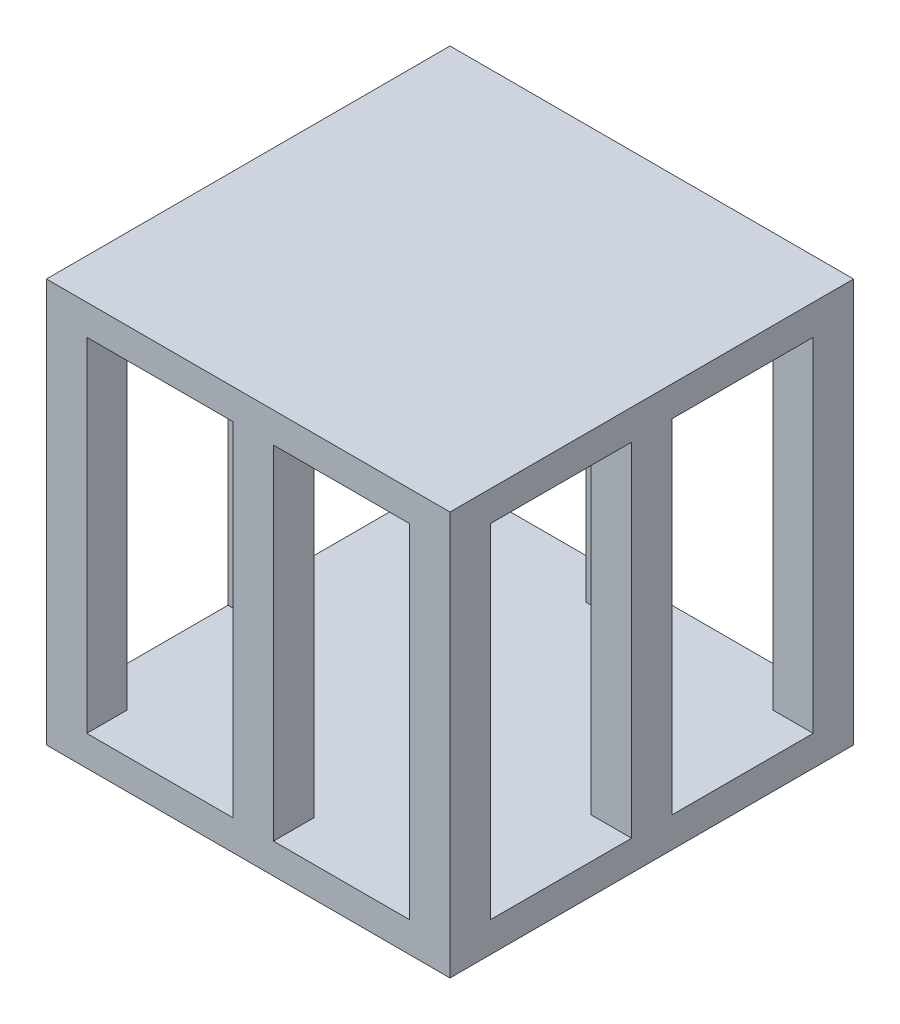
ISO-10303-21;
HEADER;
FILE_DESCRIPTION(('STEP AP214'),'2;1');
FILE_NAME('part.step','',(''),(''),'','','');
FILE_SCHEMA(('AUTOMOTIVE_DESIGN { 1 0 10303 214 1 1 1 1 }'));
ENDSEC;
DATA;
#1=APPLICATION_CONTEXT('core data for automotive mechanical design processes');
#2=APPLICATION_PROTOCOL_DEFINITION('international standard','automotive_design',2000,#1);
#3=PRODUCT_CONTEXT('',#1,'mechanical');
#4=PRODUCT('Part','Part','',(#3));
#5=PRODUCT_RELATED_PRODUCT_CATEGORY('part','',(#4));
#6=PRODUCT_DEFINITION_FORMATION('','',#4);
#7=PRODUCT_DEFINITION_CONTEXT('part definition',#1,'design');
#8=PRODUCT_DEFINITION('design','',#6,#7);
#9=PRODUCT_DEFINITION_SHAPE('','',#8);
#10=(LENGTH_UNIT() NAMED_UNIT(*) SI_UNIT(.MILLI.,.METRE.));
#11=(NAMED_UNIT(*) PLANE_ANGLE_UNIT() SI_UNIT($,.RADIAN.));
#12=(NAMED_UNIT(*) SI_UNIT($,.STERADIAN.) SOLID_ANGLE_UNIT());
#13=UNCERTAINTY_MEASURE_WITH_UNIT(LENGTH_MEASURE(1.E-05),#10,'distance_accuracy_value','');
#14=(GEOMETRIC_REPRESENTATION_CONTEXT(3) GLOBAL_UNCERTAINTY_ASSIGNED_CONTEXT((#13)) GLOBAL_UNIT_ASSIGNED_CONTEXT((#10,
#11,#12)) REPRESENTATION_CONTEXT('',''));
#15=CARTESIAN_POINT('',(0.,0.,0.));
#16=DIRECTION('',(0.,0.,1.));
#17=DIRECTION('',(1.,0.,0.));
#18=AXIS2_PLACEMENT_3D('',#15,#16,#17);
#19=CARTESIAN_POINT('',(25.4,21.59,-25.4));
#20=DIRECTION('',(0.,1.,0.));
#21=DIRECTION('',(0.,0.,1.));
#22=AXIS2_PLACEMENT_3D('',#19,#20,#21);
#23=PLANE('',#22);
#24=DIRECTION('',(0.,0.,-1.));
#25=VECTOR('',#24,1.);
#26=CARTESIAN_POINT('',(-3.17500000000003,21.59,-45.72));
#27=LINE('',#26,#25);
#28=CARTESIAN_POINT('',(-3.17500000000003,21.59,-20.32));
#29=VERTEX_POINT('',#28);
#30=CARTESIAN_POINT('',(-3.17500000000003,21.59,-25.4));
#31=VERTEX_POINT('',#30);
#32=EDGE_CURVE('E53',#29,#31,#27,.T.);
#33=ORIENTED_EDGE('',*,*,#32,.F.);
#34=DIRECTION('',(-1.,0.,0.));
#35=VECTOR('',#34,1.);
#36=CARTESIAN_POINT('',(32.5264213562373,21.59,-20.32));
#37=LINE('',#36,#35);
#38=CARTESIAN_POINT('',(1.90499999999998,21.59,-20.32));
#39=VERTEX_POINT('',#38);
#40=EDGE_CURVE('E294',#39,#29,#37,.T.);
#41=ORIENTED_EDGE('',*,*,#40,.F.);
#42=DIRECTION('',(0.,0.,-1.));
#43=VECTOR('',#42,1.);
#44=CARTESIAN_POINT('',(1.90499999999998,21.59,-45.72));
#45=LINE('',#44,#43);
#46=CARTESIAN_POINT('',(1.90499999999998,21.59,-25.4));
#47=VERTEX_POINT('',#46);
#48=EDGE_CURVE('E299',#39,#47,#45,.T.);
#49=ORIENTED_EDGE('',*,*,#48,.T.);
#50=DIRECTION('',(-1.,0.,0.));
#51=VECTOR('',#50,1.);
#52=CARTESIAN_POINT('',(25.4,21.59,-25.4));
#53=LINE('',#52,#51);
#54=CARTESIAN_POINT('',(20.32,21.59,-25.4));
#55=VERTEX_POINT('',#54);
#56=EDGE_CURVE('E467',#55,#47,#53,.T.);
#57=ORIENTED_EDGE('',*,*,#56,.F.);
#58=DIRECTION('',(0.,0.,-1.));
#59=VECTOR('',#58,1.);
#60=CARTESIAN_POINT('',(20.32,21.59,-45.72));
#61=LINE('',#60,#59);
#62=CARTESIAN_POINT('',(20.32,21.59,-20.32));
#63=VERTEX_POINT('',#62);
#64=EDGE_CURVE('E395',#63,#55,#61,.T.);
#65=ORIENTED_EDGE('',*,*,#64,.F.);
#66=DIRECTION('',(-1.,0.,0.));
#67=VECTOR('',#66,1.);
#68=CARTESIAN_POINT('',(56.0214213562373,21.59,-20.32));
#69=LINE('',#68,#67);
#70=CARTESIAN_POINT('',(25.4,21.59,-20.32));
#71=VERTEX_POINT('',#70);
#72=EDGE_CURVE('E392',#71,#63,#69,.T.);
#73=ORIENTED_EDGE('',*,*,#72,.F.);
#74=DIRECTION('',(0.,0.,-1.));
#75=VECTOR('',#74,1.);
#76=CARTESIAN_POINT('',(25.4,21.59,25.4));
#77=LINE('',#76,#75);
#78=CARTESIAN_POINT('',(25.4,21.59,-2.54));
#79=VERTEX_POINT('',#78);
#80=EDGE_CURVE('E455',#79,#71,#77,.T.);
#81=ORIENTED_EDGE('',*,*,#80,.F.);
#82=DIRECTION('',(-1.,0.,0.));
#83=VECTOR('',#82,1.);
#84=CARTESIAN_POINT('',(56.0214213562373,21.59,-2.54000000000001));
#85=LINE('',#84,#83);
#86=CARTESIAN_POINT('',(20.32,21.59,-2.54000000000001));
#87=VERTEX_POINT('',#86);
#88=EDGE_CURVE('E371',#79,#87,#85,.T.);
#89=ORIENTED_EDGE('',*,*,#88,.T.);
#90=DIRECTION('',(0.,0.,-1.));
#91=VECTOR('',#90,1.);
#92=CARTESIAN_POINT('',(20.32,21.59,-22.86));
#93=LINE('',#92,#91);
#94=CARTESIAN_POINT('',(20.32,21.59,2.53999999999999));
#95=VERTEX_POINT('',#94);
#96=EDGE_CURVE('E367',#95,#87,#93,.T.);
#97=ORIENTED_EDGE('',*,*,#96,.F.);
#98=DIRECTION('',(-1.,0.,0.));
#99=VECTOR('',#98,1.);
#100=CARTESIAN_POINT('',(56.0214213562373,21.59,2.53999999999999));
#101=LINE('',#100,#99);
#102=CARTESIAN_POINT('',(25.4,21.59,2.53999999999999));
#103=VERTEX_POINT('',#102);
#104=EDGE_CURVE('E364',#103,#95,#101,.T.);
#105=ORIENTED_EDGE('',*,*,#104,.F.);
#106=CARTESIAN_POINT('',(25.4,21.59,20.32));
#107=VERTEX_POINT('',#106);
#108=EDGE_CURVE('E464',#107,#103,#77,.T.);
#109=ORIENTED_EDGE('',*,*,#108,.F.);
#110=DIRECTION('',(-1.,0.,0.));
#111=VECTOR('',#110,1.);
#112=CARTESIAN_POINT('',(56.0214213562373,21.59,20.32));
#113=LINE('',#112,#111);
#114=CARTESIAN_POINT('',(20.32,21.59,20.32));
#115=VERTEX_POINT('',#114);
#116=EDGE_CURVE('E349',#107,#115,#113,.T.);
#117=ORIENTED_EDGE('',*,*,#116,.T.);
#118=DIRECTION('',(0.,0.,-1.));
#119=VECTOR('',#118,1.);
#120=CARTESIAN_POINT('',(20.32,21.59,0.));
#121=LINE('',#120,#119);
#122=CARTESIAN_POINT('',(20.32,21.59,25.4));
#123=VERTEX_POINT('',#122);
#124=EDGE_CURVE('E346',#123,#115,#121,.T.);
#125=ORIENTED_EDGE('',*,*,#124,.F.);
#126=DIRECTION('',(1.,0.,0.));
#127=VECTOR('',#126,1.);
#128=CARTESIAN_POINT('',(25.4,21.59,25.4));
#129=LINE('',#128,#127);
#130=CARTESIAN_POINT('',(3.17500000000003,21.59,25.4));
#131=VERTEX_POINT('',#130);
#132=EDGE_CURVE('E39',#131,#123,#129,.T.);
#133=ORIENTED_EDGE('',*,*,#132,.F.);
#134=DIRECTION('',(0.,0.,-1.));
#135=VECTOR('',#134,1.);
#136=CARTESIAN_POINT('',(3.17500000000003,21.59,0.));
#137=LINE('',#136,#135);
#138=CARTESIAN_POINT('',(3.17500000000003,21.59,20.32));
#139=VERTEX_POINT('',#138);
#140=EDGE_CURVE('E320',#131,#139,#137,.T.);
#141=ORIENTED_EDGE('',*,*,#140,.T.);
#142=DIRECTION('',(1.,0.,0.));
#143=VECTOR('',#142,1.);
#144=CARTESIAN_POINT('',(-32.5264213562373,21.59,20.32));
#145=LINE('',#144,#143);
#146=CARTESIAN_POINT('',(-1.90499999999998,21.59,20.32));
#147=VERTEX_POINT('',#146);
#148=EDGE_CURVE('E323',#147,#139,#145,.T.);
#149=ORIENTED_EDGE('',*,*,#148,.F.);
#150=DIRECTION('',(0.,0.,-1.));
#151=VECTOR('',#150,1.);
#152=CARTESIAN_POINT('',(-1.90499999999998,21.59,0.));
#153=LINE('',#152,#151);
#154=CARTESIAN_POINT('',(-1.90499999999998,21.59,25.4));
#155=VERTEX_POINT('',#154);
#156=EDGE_CURVE('E327',#155,#147,#153,.T.);
#157=ORIENTED_EDGE('',*,*,#156,.F.);
#158=CARTESIAN_POINT('',(-20.32,21.59,25.4));
#159=VERTEX_POINT('',#158);
#160=EDGE_CURVE('E458',#159,#155,#129,.T.);
#161=ORIENTED_EDGE('',*,*,#160,.F.);
#162=DIRECTION('',(0.,0.,-1.));
#163=VECTOR('',#162,1.);
#164=CARTESIAN_POINT('',(-20.32,21.59,0.));
#165=LINE('',#164,#163);
#166=CARTESIAN_POINT('',(-20.32,21.59,20.32));
#167=VERTEX_POINT('',#166);
#168=EDGE_CURVE('E479',#159,#167,#165,.T.);
#169=ORIENTED_EDGE('',*,*,#168,.T.);
#170=DIRECTION('',(1.,0.,0.));
#171=VECTOR('',#170,1.);
#172=CARTESIAN_POINT('',(-56.0214213562373,21.59,20.32));
#173=LINE('',#172,#171);
#174=CARTESIAN_POINT('',(-25.4,21.59,20.32));
#175=VERTEX_POINT('',#174);
#176=EDGE_CURVE('E482',#175,#167,#173,.T.);
#177=ORIENTED_EDGE('',*,*,#176,.F.);
#178=DIRECTION('',(0.,0.,1.));
#179=VECTOR('',#178,1.);
#180=CARTESIAN_POINT('',(-25.4,21.59,25.4));
#181=LINE('',#180,#179);
#182=CARTESIAN_POINT('',(-25.4,21.59,2.53999999999999));
#183=VERTEX_POINT('',#182);
#184=EDGE_CURVE('E470',#183,#175,#181,.T.);
#185=ORIENTED_EDGE('',*,*,#184,.F.);
#186=DIRECTION('',(1.,0.,0.));
#187=VECTOR('',#186,1.);
#188=CARTESIAN_POINT('',(-56.0214213562373,21.59,2.53999999999999));
#189=LINE('',#188,#187);
#190=CARTESIAN_POINT('',(-20.32,21.59,2.53999999999999));
#191=VERTEX_POINT('',#190);
#192=EDGE_CURVE('E429',#183,#191,#189,.T.);
#193=ORIENTED_EDGE('',*,*,#192,.T.);
#194=DIRECTION('',(0.,0.,-1.));
#195=VECTOR('',#194,1.);
#196=CARTESIAN_POINT('',(-20.32,21.59,-22.86));
#197=LINE('',#196,#195);
#198=CARTESIAN_POINT('',(-20.32,21.59,-2.54000000000001));
#199=VERTEX_POINT('',#198);
#200=EDGE_CURVE('E432',#191,#199,#197,.T.);
#201=ORIENTED_EDGE('',*,*,#200,.T.);
#202=DIRECTION('',(1.,0.,0.));
#203=VECTOR('',#202,1.);
#204=CARTESIAN_POINT('',(-56.0214213562373,21.59,-2.54000000000001));
#205=LINE('',#204,#203);
#206=CARTESIAN_POINT('',(-25.4,21.59,-2.54000000000001));
#207=VERTEX_POINT('',#206);
#208=EDGE_CURVE('E436',#207,#199,#205,.T.);
#209=ORIENTED_EDGE('',*,*,#208,.F.);
#210=CARTESIAN_POINT('',(-25.4,21.59,-20.32));
#211=VERTEX_POINT('',#210);
#212=EDGE_CURVE('E474',#211,#207,#181,.T.);
#213=ORIENTED_EDGE('',*,*,#212,.F.);
#214=DIRECTION('',(1.,0.,0.));
#215=VECTOR('',#214,1.);
#216=CARTESIAN_POINT('',(-56.0214213562373,21.59,-20.32));
#217=LINE('',#216,#215);
#218=CARTESIAN_POINT('',(-20.32,21.59,-20.32));
#219=VERTEX_POINT('',#218);
#220=EDGE_CURVE('E411',#211,#219,#217,.T.);
#221=ORIENTED_EDGE('',*,*,#220,.T.);
#222=DIRECTION('',(0.,0.,-1.));
#223=VECTOR('',#222,1.);
#224=CARTESIAN_POINT('',(-20.32,21.59,-45.72));
#225=LINE('',#224,#223);
#226=CARTESIAN_POINT('',(-20.32,21.59,-25.4));
#227=VERTEX_POINT('',#226);
#228=EDGE_CURVE('E414',#219,#227,#225,.T.);
#229=ORIENTED_EDGE('',*,*,#228,.T.);
#230=EDGE_CURVE('E466',#31,#227,#53,.T.);
#231=ORIENTED_EDGE('',*,*,#230,.F.);
#232=EDGE_LOOP('',(#33,#41,#49,#57,#65,#73,#81,#89,#97,#105,#109,#117,#125,#133,#141,#149,#157,
#161,#169,#177,#185,#193,#201,#209,#213,#221,#229,#231));
#233=FACE_BOUND('',#232,.T.);
#234=ADVANCED_FACE('F35',(#233),#23,.F.);
#235=CARTESIAN_POINT('',(-56.0214213562373,21.59,25.4));
#236=DIRECTION('',(0.,0.,-1.));
#237=DIRECTION('',(-1.,0.,0.));
#238=AXIS2_PLACEMENT_3D('',#235,#236,#237);
#239=PLANE('',#238);
#240=DIRECTION('',(-1.,0.,0.));
#241=VECTOR('',#240,1.);
#242=CARTESIAN_POINT('',(25.4,-21.59,25.4));
#243=LINE('',#242,#241);
#244=CARTESIAN_POINT('',(-1.90499999999998,-21.59,25.4));
#245=VERTEX_POINT('',#244);
#246=CARTESIAN_POINT('',(-20.32,-21.59,25.4));
#247=VERTEX_POINT('',#246);
#248=EDGE_CURVE('E286',#245,#247,#243,.T.);
#249=ORIENTED_EDGE('',*,*,#248,.T.);
#250=DIRECTION('',(0.,-1.,0.));
#251=VECTOR('',#250,1.);
#252=CARTESIAN_POINT('',(-20.32,21.59,25.4));
#253=LINE('',#252,#251);
#254=EDGE_CURVE('E11',#159,#247,#253,.T.);
#255=ORIENTED_EDGE('',*,*,#254,.F.);
#256=ORIENTED_EDGE('',*,*,#160,.T.);
#257=DIRECTION('',(0.,-1.,0.));
#258=VECTOR('',#257,1.);
#259=CARTESIAN_POINT('',(-1.90499999999998,21.59,25.4));
#260=LINE('',#259,#258);
#261=EDGE_CURVE('E330',#155,#245,#260,.T.);
#262=ORIENTED_EDGE('',*,*,#261,.T.);
#263=EDGE_LOOP('',(#249,#255,#256,#262));
#264=FACE_BOUND('',#263,.T.);
#265=DIRECTION('',(0.,-1.,0.));
#266=VECTOR('',#265,1.);
#267=CARTESIAN_POINT('',(20.32,21.59,25.4));
#268=LINE('',#267,#266);
#269=CARTESIAN_POINT('',(20.32,-21.59,25.4));
#270=VERTEX_POINT('',#269);
#271=EDGE_CURVE('E361',#123,#270,#268,.T.);
#272=ORIENTED_EDGE('',*,*,#271,.T.);
#273=CARTESIAN_POINT('',(3.17500000000003,-21.59,25.4));
#274=VERTEX_POINT('',#273);
#275=EDGE_CURVE('E289',#270,#274,#243,.T.);
#276=ORIENTED_EDGE('',*,*,#275,.T.);
#277=DIRECTION('',(0.,-1.,0.));
#278=VECTOR('',#277,1.);
#279=CARTESIAN_POINT('',(3.17500000000003,21.59,25.4));
#280=LINE('',#279,#278);
#281=EDGE_CURVE('E61',#131,#274,#280,.T.);
#282=ORIENTED_EDGE('',*,*,#281,.F.);
#283=ORIENTED_EDGE('',*,*,#132,.T.);
#284=EDGE_LOOP('',(#272,#276,#282,#283));
#285=FACE_BOUND('',#284,.T.);
#286=DIRECTION('',(0.,-1.,0.));
#287=VECTOR('',#286,1.);
#288=CARTESIAN_POINT('',(-25.4,21.59,25.4));
#289=LINE('',#288,#287);
#290=CARTESIAN_POINT('',(-25.4,25.4,25.4));
#291=VERTEX_POINT('',#290);
#292=CARTESIAN_POINT('',(-25.4,-25.4,25.4));
#293=VERTEX_POINT('',#292);
#294=EDGE_CURVE('E264',#291,#293,#289,.T.);
#295=ORIENTED_EDGE('',*,*,#294,.T.);
#296=DIRECTION('',(-1.,0.,0.));
#297=VECTOR('',#296,1.);
#298=CARTESIAN_POINT('',(25.4,-25.4,25.4));
#299=LINE('',#298,#297);
#300=CARTESIAN_POINT('',(25.4,-25.4,25.4));
#301=VERTEX_POINT('',#300);
#302=EDGE_CURVE('E263',#301,#293,#299,.T.);
#303=ORIENTED_EDGE('',*,*,#302,.F.);
#304=DIRECTION('',(0.,-1.,0.));
#305=VECTOR('',#304,1.);
#306=CARTESIAN_POINT('',(25.4,25.4,25.4));
#307=LINE('',#306,#305);
#308=CARTESIAN_POINT('',(25.4,25.4,25.4));
#309=VERTEX_POINT('',#308);
#310=EDGE_CURVE('E248',#309,#301,#307,.T.);
#311=ORIENTED_EDGE('',*,*,#310,.F.);
#312=DIRECTION('',(1.,0.,0.));
#313=VECTOR('',#312,1.);
#314=CARTESIAN_POINT('',(25.4,25.4,25.4));
#315=LINE('',#314,#313);
#316=EDGE_CURVE('E260',#291,#309,#315,.T.);
#317=ORIENTED_EDGE('',*,*,#316,.F.);
#318=EDGE_LOOP('',(#295,#303,#311,#317));
#319=FACE_BOUND('',#318,.T.);
#320=ADVANCED_FACE('F37',(#264,#285,#319),#239,.F.);
#321=CARTESIAN_POINT('',(-20.32,21.59,0.));
#322=DIRECTION('',(-1.,0.,0.));
#323=DIRECTION('',(0.,0.,1.));
#324=AXIS2_PLACEMENT_3D('',#321,#322,#323);
#325=PLANE('',#324);
#326=DIRECTION('',(0.,0.,-1.));
#327=VECTOR('',#326,1.);
#328=CARTESIAN_POINT('',(-20.32,-21.59,0.));
#329=LINE('',#328,#327);
#330=CARTESIAN_POINT('',(-20.32,-21.59,20.32));
#331=VERTEX_POINT('',#330);
#332=EDGE_CURVE('E490',#247,#331,#329,.T.);
#333=ORIENTED_EDGE('',*,*,#332,.T.);
#334=DIRECTION('',(0.,-1.,0.));
#335=VECTOR('',#334,1.);
#336=CARTESIAN_POINT('',(-20.32,21.59,20.32));
#337=LINE('',#336,#335);
#338=EDGE_CURVE('E45',#167,#331,#337,.T.);
#339=ORIENTED_EDGE('',*,*,#338,.F.);
#340=ORIENTED_EDGE('',*,*,#168,.F.);
#341=ORIENTED_EDGE('',*,*,#254,.T.);
#342=EDGE_LOOP('',(#333,#339,#340,#341));
#343=FACE_BOUND('',#342,.T.);
#344=ADVANCED_FACE('F526',(#343),#325,.F.);
#345=CARTESIAN_POINT('',(-56.0214213562373,21.59,20.32));
#346=DIRECTION('',(0.,0.,-1.));
#347=DIRECTION('',(-1.,0.,0.));
#348=AXIS2_PLACEMENT_3D('',#345,#346,#347);
#349=PLANE('',#348);
#350=DIRECTION('',(1.,0.,0.));
#351=VECTOR('',#350,1.);
#352=CARTESIAN_POINT('',(-56.0214213562373,-21.59,20.32));
#353=LINE('',#352,#351);
#354=CARTESIAN_POINT('',(-25.4,-21.59,20.32));
#355=VERTEX_POINT('',#354);
#356=EDGE_CURVE('E483',#355,#331,#353,.T.);
#357=ORIENTED_EDGE('',*,*,#356,.F.);
#358=DIRECTION('',(0.,-1.,0.));
#359=VECTOR('',#358,1.);
#360=CARTESIAN_POINT('',(-25.4,21.59,20.32));
#361=LINE('',#360,#359);
#362=EDGE_CURVE('E497',#175,#355,#361,.T.);
#363=ORIENTED_EDGE('',*,*,#362,.F.);
#364=ORIENTED_EDGE('',*,*,#176,.T.);
#365=ORIENTED_EDGE('',*,*,#338,.T.);
#366=EDGE_LOOP('',(#357,#363,#364,#365));
#367=FACE_BOUND('',#366,.T.);
#368=ADVANCED_FACE('F524',(#367),#349,.T.);
#369=CARTESIAN_POINT('',(-25.4,21.59,0.));
#370=DIRECTION('',(-1.,0.,0.));
#371=DIRECTION('',(0.,0.,1.));
#372=AXIS2_PLACEMENT_3D('',#369,#370,#371);
#373=PLANE('',#372);
#374=ORIENTED_EDGE('',*,*,#362,.T.);
#375=DIRECTION('',(0.,0.,-1.));
#376=VECTOR('',#375,1.);
#377=CARTESIAN_POINT('',(-25.4,-21.59,25.4));
#378=LINE('',#377,#376);
#379=CARTESIAN_POINT('',(-25.4,-21.59,2.53999999999999));
#380=VERTEX_POINT('',#379);
#381=EDGE_CURVE('E292',#355,#380,#378,.T.);
#382=ORIENTED_EDGE('',*,*,#381,.T.);
#383=DIRECTION('',(0.,-1.,0.));
#384=VECTOR('',#383,1.);
#385=CARTESIAN_POINT('',(-25.4,21.59,2.53999999999999));
#386=LINE('',#385,#384);
#387=EDGE_CURVE('E439',#183,#380,#386,.T.);
#388=ORIENTED_EDGE('',*,*,#387,.F.);
#389=ORIENTED_EDGE('',*,*,#184,.T.);
#390=EDGE_LOOP('',(#374,#382,#388,#389));
#391=FACE_BOUND('',#390,.T.);
#392=DIRECTION('',(0.,-1.,0.));
#393=VECTOR('',#392,1.);
#394=CARTESIAN_POINT('',(-25.4,21.59,-2.54000000000001));
#395=LINE('',#394,#393);
#396=CARTESIAN_POINT('',(-25.4,-21.59,-2.54000000000001));
#397=VERTEX_POINT('',#396);
#398=EDGE_CURVE('E448',#207,#397,#395,.T.);
#399=ORIENTED_EDGE('',*,*,#398,.T.);
#400=CARTESIAN_POINT('',(-25.4,-21.59,-20.32));
#401=VERTEX_POINT('',#400);
#402=EDGE_CURVE('E290',#397,#401,#378,.T.);
#403=ORIENTED_EDGE('',*,*,#402,.T.);
#404=DIRECTION('',(0.,-1.,0.));
#405=VECTOR('',#404,1.);
#406=CARTESIAN_POINT('',(-25.4,21.59,-20.32));
#407=LINE('',#406,#405);
#408=EDGE_CURVE('E418',#211,#401,#407,.T.);
#409=ORIENTED_EDGE('',*,*,#408,.F.);
#410=ORIENTED_EDGE('',*,*,#212,.T.);
#411=EDGE_LOOP('',(#399,#403,#409,#410));
#412=FACE_BOUND('',#411,.T.);
#413=DIRECTION('',(0.,0.,-1.));
#414=VECTOR('',#413,1.);
#415=CARTESIAN_POINT('',(-25.4,-25.4,25.4));
#416=LINE('',#415,#414);
#417=CARTESIAN_POINT('',(-25.4,-25.4,-25.4));
#418=VERTEX_POINT('',#417);
#419=EDGE_CURVE('E268',#293,#418,#416,.T.);
#420=ORIENTED_EDGE('',*,*,#419,.F.);
#421=ORIENTED_EDGE('',*,*,#294,.F.);
#422=DIRECTION('',(0.,0.,1.));
#423=VECTOR('',#422,1.);
#424=CARTESIAN_POINT('',(-25.4,25.4,25.4));
#425=LINE('',#424,#423);
#426=CARTESIAN_POINT('',(-25.4,25.4,-25.4));
#427=VERTEX_POINT('',#426);
#428=EDGE_CURVE('E460',#427,#291,#425,.T.);
#429=ORIENTED_EDGE('',*,*,#428,.F.);
#430=DIRECTION('',(0.,-1.,0.));
#431=VECTOR('',#430,1.);
#432=CARTESIAN_POINT('',(-25.4,25.4,-25.4));
#433=LINE('',#432,#431);
#434=EDGE_CURVE('E259',#427,#418,#433,.T.);
#435=ORIENTED_EDGE('',*,*,#434,.T.);
#436=EDGE_LOOP('',(#420,#421,#429,#435));
#437=FACE_BOUND('',#436,.T.);
#438=ADVANCED_FACE('F507',(#391,#412,#437),#373,.T.);
#439=CARTESIAN_POINT('',(25.4,25.4,25.4));
#440=DIRECTION('',(-1.,0.,0.));
#441=DIRECTION('',(0.,0.,1.));
#442=AXIS2_PLACEMENT_3D('',#439,#440,#441);
#443=PLANE('',#442);
#444=DIRECTION('',(0.,0.,1.));
#445=VECTOR('',#444,1.);
#446=CARTESIAN_POINT('',(25.4,-25.4,25.4));
#447=LINE('',#446,#445);
#448=CARTESIAN_POINT('',(25.4,-25.4,-25.4));
#449=VERTEX_POINT('',#448);
#450=EDGE_CURVE('E254',#449,#301,#447,.T.);
#451=ORIENTED_EDGE('',*,*,#450,.F.);
#452=DIRECTION('',(0.,-1.,0.));
#453=VECTOR('',#452,1.);
#454=CARTESIAN_POINT('',(25.4,25.4,-25.4));
#455=LINE('',#454,#453);
#456=CARTESIAN_POINT('',(25.4,25.4,-25.4));
#457=VERTEX_POINT('',#456);
#458=EDGE_CURVE('E493',#457,#449,#455,.T.);
#459=ORIENTED_EDGE('',*,*,#458,.F.);
#460=DIRECTION('',(0.,0.,-1.));
#461=VECTOR('',#460,1.);
#462=CARTESIAN_POINT('',(25.4,25.4,25.4));
#463=LINE('',#462,#461);
#464=EDGE_CURVE('E256',#309,#457,#463,.T.);
#465=ORIENTED_EDGE('',*,*,#464,.F.);
#466=ORIENTED_EDGE('',*,*,#310,.T.);
#467=EDGE_LOOP('',(#451,#459,#465,#466));
#468=FACE_BOUND('',#467,.T.);
#469=DIRECTION('',(0.,0.,1.));
#470=VECTOR('',#469,1.);
#471=CARTESIAN_POINT('',(25.4,-21.59,25.4));
#472=LINE('',#471,#470);
#473=CARTESIAN_POINT('',(25.4,-21.59,-20.32));
#474=VERTEX_POINT('',#473);
#475=CARTESIAN_POINT('',(25.4,-21.59,-2.54000000000001));
#476=VERTEX_POINT('',#475);
#477=EDGE_CURVE('E285',#474,#476,#472,.T.);
#478=ORIENTED_EDGE('',*,*,#477,.T.);
#479=DIRECTION('',(0.,-1.,0.));
#480=VECTOR('',#479,1.);
#481=CARTESIAN_POINT('',(25.4,21.59,-2.54000000000001));
#482=LINE('',#481,#480);
#483=EDGE_CURVE('E382',#79,#476,#482,.T.);
#484=ORIENTED_EDGE('',*,*,#483,.F.);
#485=ORIENTED_EDGE('',*,*,#80,.T.);
#486=DIRECTION('',(0.,-1.,0.));
#487=VECTOR('',#486,1.);
#488=CARTESIAN_POINT('',(25.4,21.59,-20.32));
#489=LINE('',#488,#487);
#490=EDGE_CURVE('E398',#71,#474,#489,.T.);
#491=ORIENTED_EDGE('',*,*,#490,.T.);
#492=EDGE_LOOP('',(#478,#484,#485,#491));
#493=FACE_BOUND('',#492,.T.);
#494=DIRECTION('',(0.,-1.,0.));
#495=VECTOR('',#494,1.);
#496=CARTESIAN_POINT('',(25.4,21.59,2.53999999999999));
#497=LINE('',#496,#495);
#498=CARTESIAN_POINT('',(25.4,-21.59,2.53999999999999));
#499=VERTEX_POINT('',#498);
#500=EDGE_CURVE('E374',#103,#499,#497,.T.);
#501=ORIENTED_EDGE('',*,*,#500,.T.);
#502=CARTESIAN_POINT('',(25.4,-21.59,20.32));
#503=VERTEX_POINT('',#502);
#504=EDGE_CURVE('E282',#499,#503,#472,.T.);
#505=ORIENTED_EDGE('',*,*,#504,.T.);
#506=DIRECTION('',(0.,-1.,0.));
#507=VECTOR('',#506,1.);
#508=CARTESIAN_POINT('',(25.4,21.59,20.32));
#509=LINE('',#508,#507);
#510=EDGE_CURVE('E353',#107,#503,#509,.T.);
#511=ORIENTED_EDGE('',*,*,#510,.F.);
#512=ORIENTED_EDGE('',*,*,#108,.T.);
#513=EDGE_LOOP('',(#501,#505,#511,#512));
#514=FACE_BOUND('',#513,.T.);
#515=ADVANCED_FACE('F250',(#468,#493,#514),#443,.F.);
#516=CARTESIAN_POINT('',(25.4,25.4,-25.4));
#517=DIRECTION('',(0.,0.,1.));
#518=DIRECTION('',(1.,0.,0.));
#519=AXIS2_PLACEMENT_3D('',#516,#517,#518);
#520=PLANE('',#519);
#521=DIRECTION('',(0.,-1.,0.));
#522=VECTOR('',#521,1.);
#523=CARTESIAN_POINT('',(-20.32,21.59,-25.4));
#524=LINE('',#523,#522);
#525=CARTESIAN_POINT('',(-20.32,-21.59,-25.4));
#526=VERTEX_POINT('',#525);
#527=EDGE_CURVE('E423',#227,#526,#524,.T.);
#528=ORIENTED_EDGE('',*,*,#527,.T.);
#529=DIRECTION('',(1.,0.,0.));
#530=VECTOR('',#529,1.);
#531=CARTESIAN_POINT('',(25.4,-21.59,-25.4));
#532=LINE('',#531,#530);
#533=CARTESIAN_POINT('',(-3.17500000000003,-21.59,-25.4));
#534=VERTEX_POINT('',#533);
#535=EDGE_CURVE('E274',#526,#534,#532,.T.);
#536=ORIENTED_EDGE('',*,*,#535,.T.);
#537=DIRECTION('',(0.,-1.,0.));
#538=VECTOR('',#537,1.);
#539=CARTESIAN_POINT('',(-3.17500000000003,21.59,-25.4));
#540=LINE('',#539,#538);
#541=EDGE_CURVE('E314',#31,#534,#540,.T.);
#542=ORIENTED_EDGE('',*,*,#541,.F.);
#543=ORIENTED_EDGE('',*,*,#230,.T.);
#544=EDGE_LOOP('',(#528,#536,#542,#543));
#545=FACE_BOUND('',#544,.T.);
#546=CARTESIAN_POINT('',(1.90499999999998,-21.59,-25.4));
#547=VERTEX_POINT('',#546);
#548=CARTESIAN_POINT('',(20.32,-21.59,-25.4));
#549=VERTEX_POINT('',#548);
#550=EDGE_CURVE('E276',#547,#549,#532,.T.);
#551=ORIENTED_EDGE('',*,*,#550,.T.);
#552=DIRECTION('',(0.,-1.,0.));
#553=VECTOR('',#552,1.);
#554=CARTESIAN_POINT('',(20.32,21.59,-25.4));
#555=LINE('',#554,#553);
#556=EDGE_CURVE('E404',#55,#549,#555,.T.);
#557=ORIENTED_EDGE('',*,*,#556,.F.);
#558=ORIENTED_EDGE('',*,*,#56,.T.);
#559=DIRECTION('',(0.,-1.,0.));
#560=VECTOR('',#559,1.);
#561=CARTESIAN_POINT('',(1.90499999999998,21.59,-25.4));
#562=LINE('',#561,#560);
#563=EDGE_CURVE('E311',#47,#547,#562,.T.);
#564=ORIENTED_EDGE('',*,*,#563,.T.);
#565=EDGE_LOOP('',(#551,#557,#558,#564));
#566=FACE_BOUND('',#565,.T.);
#567=ORIENTED_EDGE('',*,*,#458,.T.);
#568=DIRECTION('',(1.,0.,0.));
#569=VECTOR('',#568,1.);
#570=CARTESIAN_POINT('',(25.4,-25.4,-25.4));
#571=LINE('',#570,#569);
#572=EDGE_CURVE('E273',#418,#449,#571,.T.);
#573=ORIENTED_EDGE('',*,*,#572,.F.);
#574=ORIENTED_EDGE('',*,*,#434,.F.);
#575=DIRECTION('',(-1.,0.,0.));
#576=VECTOR('',#575,1.);
#577=CARTESIAN_POINT('',(25.4,25.4,-25.4));
#578=LINE('',#577,#576);
#579=EDGE_CURVE('E457',#457,#427,#578,.T.);
#580=ORIENTED_EDGE('',*,*,#579,.F.);
#581=EDGE_LOOP('',(#567,#573,#574,#580));
#582=FACE_BOUND('',#581,.T.);
#583=ADVANCED_FACE('F566',(#545,#566,#582),#520,.F.);
#584=CARTESIAN_POINT('',(25.4,25.4,-25.4));
#585=DIRECTION('',(0.,1.,0.));
#586=DIRECTION('',(0.,0.,1.));
#587=AXIS2_PLACEMENT_3D('',#584,#585,#586);
#588=PLANE('',#587);
#589=ORIENTED_EDGE('',*,*,#464,.T.);
#590=ORIENTED_EDGE('',*,*,#579,.T.);
#591=ORIENTED_EDGE('',*,*,#428,.T.);
#592=ORIENTED_EDGE('',*,*,#316,.T.);
#593=EDGE_LOOP('',(#589,#590,#591,#592));
#594=FACE_BOUND('',#593,.T.);
#595=ADVANCED_FACE('F590',(#594),#588,.T.);
#596=CARTESIAN_POINT('',(-56.0214213562373,21.59,2.53999999999999));
#597=DIRECTION('',(0.,0.,-1.));
#598=DIRECTION('',(-1.,0.,0.));
#599=AXIS2_PLACEMENT_3D('',#596,#597,#598);
#600=PLANE('',#599);
#601=DIRECTION('',(1.,0.,0.));
#602=VECTOR('',#601,1.);
#603=CARTESIAN_POINT('',(-56.0214213562373,-21.59,2.53999999999999));
#604=LINE('',#603,#602);
#605=CARTESIAN_POINT('',(-20.32,-21.59,2.53999999999999));
#606=VERTEX_POINT('',#605);
#607=EDGE_CURVE('E428',#380,#606,#604,.T.);
#608=ORIENTED_EDGE('',*,*,#607,.T.);
#609=DIRECTION('',(0.,-1.,0.));
#610=VECTOR('',#609,1.);
#611=CARTESIAN_POINT('',(-20.32,21.59,2.53999999999999));
#612=LINE('',#611,#610);
#613=EDGE_CURVE('E453',#191,#606,#612,.T.);
#614=ORIENTED_EDGE('',*,*,#613,.F.);
#615=ORIENTED_EDGE('',*,*,#192,.F.);
#616=ORIENTED_EDGE('',*,*,#387,.T.);
#617=EDGE_LOOP('',(#608,#614,#615,#616));
#618=FACE_BOUND('',#617,.T.);
#619=ADVANCED_FACE('F520',(#618),#600,.F.);
#620=CARTESIAN_POINT('',(-20.32,21.59,-22.86));
#621=DIRECTION('',(-1.,0.,0.));
#622=DIRECTION('',(0.,0.,1.));
#623=AXIS2_PLACEMENT_3D('',#620,#621,#622);
#624=PLANE('',#623);
#625=DIRECTION('',(0.,0.,-1.));
#626=VECTOR('',#625,1.);
#627=CARTESIAN_POINT('',(-20.32,-21.59,-22.86));
#628=LINE('',#627,#626);
#629=CARTESIAN_POINT('',(-20.32,-21.59,-2.54000000000001));
#630=VERTEX_POINT('',#629);
#631=EDGE_CURVE('E442',#606,#630,#628,.T.);
#632=ORIENTED_EDGE('',*,*,#631,.T.);
#633=DIRECTION('',(0.,-1.,0.));
#634=VECTOR('',#633,1.);
#635=CARTESIAN_POINT('',(-20.32,21.59,-2.54000000000001));
#636=LINE('',#635,#634);
#637=EDGE_CURVE('E451',#199,#630,#636,.T.);
#638=ORIENTED_EDGE('',*,*,#637,.F.);
#639=ORIENTED_EDGE('',*,*,#200,.F.);
#640=ORIENTED_EDGE('',*,*,#613,.T.);
#641=EDGE_LOOP('',(#632,#638,#639,#640));
#642=FACE_BOUND('',#641,.T.);
#643=ADVANCED_FACE('F554',(#642),#624,.F.);
#644=CARTESIAN_POINT('',(-56.0214213562373,21.59,-2.54000000000001));
#645=DIRECTION('',(0.,0.,-1.));
#646=DIRECTION('',(-1.,0.,0.));
#647=AXIS2_PLACEMENT_3D('',#644,#645,#646);
#648=PLANE('',#647);
#649=DIRECTION('',(1.,0.,0.));
#650=VECTOR('',#649,1.);
#651=CARTESIAN_POINT('',(-56.0214213562373,-21.59,-2.54000000000001));
#652=LINE('',#651,#650);
#653=EDGE_CURVE('E433',#397,#630,#652,.T.);
#654=ORIENTED_EDGE('',*,*,#653,.F.);
#655=ORIENTED_EDGE('',*,*,#398,.F.);
#656=ORIENTED_EDGE('',*,*,#208,.T.);
#657=ORIENTED_EDGE('',*,*,#637,.T.);
#658=EDGE_LOOP('',(#654,#655,#656,#657));
#659=FACE_BOUND('',#658,.T.);
#660=ADVANCED_FACE('F552',(#659),#648,.T.);
#661=CARTESIAN_POINT('',(-56.0214213562373,21.59,-20.32));
#662=DIRECTION('',(0.,0.,-1.));
#663=DIRECTION('',(-1.,0.,0.));
#664=AXIS2_PLACEMENT_3D('',#661,#662,#663);
#665=PLANE('',#664);
#666=DIRECTION('',(1.,0.,0.));
#667=VECTOR('',#666,1.);
#668=CARTESIAN_POINT('',(-56.0214213562373,-21.59,-20.32));
#669=LINE('',#668,#667);
#670=CARTESIAN_POINT('',(-20.32,-21.59,-20.32));
#671=VERTEX_POINT('',#670);
#672=EDGE_CURVE('E410',#401,#671,#669,.T.);
#673=ORIENTED_EDGE('',*,*,#672,.T.);
#674=DIRECTION('',(0.,-1.,0.));
#675=VECTOR('',#674,1.);
#676=CARTESIAN_POINT('',(-20.32,21.59,-20.32));
#677=LINE('',#676,#675);
#678=EDGE_CURVE('E426',#219,#671,#677,.T.);
#679=ORIENTED_EDGE('',*,*,#678,.F.);
#680=ORIENTED_EDGE('',*,*,#220,.F.);
#681=ORIENTED_EDGE('',*,*,#408,.T.);
#682=EDGE_LOOP('',(#673,#679,#680,#681));
#683=FACE_BOUND('',#682,.T.);
#684=ADVANCED_FACE('F560',(#683),#665,.F.);
#685=CARTESIAN_POINT('',(-20.32,21.59,-45.72));
#686=DIRECTION('',(-1.,0.,0.));
#687=DIRECTION('',(0.,0.,1.));
#688=AXIS2_PLACEMENT_3D('',#685,#686,#687);
#689=PLANE('',#688);
#690=DIRECTION('',(0.,0.,-1.));
#691=VECTOR('',#690,1.);
#692=CARTESIAN_POINT('',(-20.32,-21.59,-45.72));
#693=LINE('',#692,#691);
#694=EDGE_CURVE('E415',#671,#526,#693,.T.);
#695=ORIENTED_EDGE('',*,*,#694,.T.);
#696=ORIENTED_EDGE('',*,*,#527,.F.);
#697=ORIENTED_EDGE('',*,*,#228,.F.);
#698=ORIENTED_EDGE('',*,*,#678,.T.);
#699=EDGE_LOOP('',(#695,#696,#697,#698));
#700=FACE_BOUND('',#699,.T.);
#701=ADVANCED_FACE('F564',(#700),#689,.F.);
#702=CARTESIAN_POINT('',(56.0214213562373,21.59,-20.32));
#703=DIRECTION('',(0.,0.,-1.));
#704=DIRECTION('',(1.,0.,0.));
#705=AXIS2_PLACEMENT_3D('',#702,#703,#704);
#706=PLANE('',#705);
#707=DIRECTION('',(-1.,0.,0.));
#708=VECTOR('',#707,1.);
#709=CARTESIAN_POINT('',(56.0214213562373,-21.59,-20.32));
#710=LINE('',#709,#708);
#711=CARTESIAN_POINT('',(20.32,-21.59,-20.32));
#712=VERTEX_POINT('',#711);
#713=EDGE_CURVE('E391',#474,#712,#710,.T.);
#714=ORIENTED_EDGE('',*,*,#713,.F.);
#715=ORIENTED_EDGE('',*,*,#490,.F.);
#716=ORIENTED_EDGE('',*,*,#72,.T.);
#717=DIRECTION('',(0.,-1.,0.));
#718=VECTOR('',#717,1.);
#719=CARTESIAN_POINT('',(20.32,21.59,-20.32));
#720=LINE('',#719,#718);
#721=EDGE_CURVE('E407',#63,#712,#720,.T.);
#722=ORIENTED_EDGE('',*,*,#721,.T.);
#723=EDGE_LOOP('',(#714,#715,#716,#722));
#724=FACE_BOUND('',#723,.T.);
#725=ADVANCED_FACE('F655',(#724),#706,.F.);
#726=CARTESIAN_POINT('',(20.32,21.59,-45.72));
#727=DIRECTION('',(1.,0.,0.));
#728=DIRECTION('',(0.,0.,1.));
#729=AXIS2_PLACEMENT_3D('',#726,#727,#728);
#730=PLANE('',#729);
#731=DIRECTION('',(0.,0.,-1.));
#732=VECTOR('',#731,1.);
#733=CARTESIAN_POINT('',(20.32,-21.59,-45.72));
#734=LINE('',#733,#732);
#735=EDGE_CURVE('E396',#712,#549,#734,.T.);
#736=ORIENTED_EDGE('',*,*,#735,.F.);
#737=ORIENTED_EDGE('',*,*,#721,.F.);
#738=ORIENTED_EDGE('',*,*,#64,.T.);
#739=ORIENTED_EDGE('',*,*,#556,.T.);
#740=EDGE_LOOP('',(#736,#737,#738,#739));
#741=FACE_BOUND('',#740,.T.);
#742=ADVANCED_FACE('F662',(#741),#730,.F.);
#743=CARTESIAN_POINT('',(56.0214213562373,21.59,2.53999999999999));
#744=DIRECTION('',(0.,0.,-1.));
#745=DIRECTION('',(1.,0.,0.));
#746=AXIS2_PLACEMENT_3D('',#743,#744,#745);
#747=PLANE('',#746);
#748=DIRECTION('',(-1.,0.,0.));
#749=VECTOR('',#748,1.);
#750=CARTESIAN_POINT('',(56.0214213562373,-21.59,2.53999999999999));
#751=LINE('',#750,#749);
#752=CARTESIAN_POINT('',(20.32,-21.59,2.53999999999999));
#753=VERTEX_POINT('',#752);
#754=EDGE_CURVE('E363',#499,#753,#751,.T.);
#755=ORIENTED_EDGE('',*,*,#754,.F.);
#756=ORIENTED_EDGE('',*,*,#500,.F.);
#757=ORIENTED_EDGE('',*,*,#104,.T.);
#758=DIRECTION('',(0.,-1.,0.));
#759=VECTOR('',#758,1.);
#760=CARTESIAN_POINT('',(20.32,21.59,2.53999999999999));
#761=LINE('',#760,#759);
#762=EDGE_CURVE('E388',#95,#753,#761,.T.);
#763=ORIENTED_EDGE('',*,*,#762,.T.);
#764=EDGE_LOOP('',(#755,#756,#757,#763));
#765=FACE_BOUND('',#764,.T.);
#766=ADVANCED_FACE('F670',(#765),#747,.F.);
#767=CARTESIAN_POINT('',(20.32,21.59,-22.86));
#768=DIRECTION('',(1.,0.,0.));
#769=DIRECTION('',(0.,0.,1.));
#770=AXIS2_PLACEMENT_3D('',#767,#768,#769);
#771=PLANE('',#770);
#772=DIRECTION('',(0.,0.,-1.));
#773=VECTOR('',#772,1.);
#774=CARTESIAN_POINT('',(20.32,-21.59,-22.86));
#775=LINE('',#774,#773);
#776=CARTESIAN_POINT('',(20.32,-21.59,-2.54000000000001));
#777=VERTEX_POINT('',#776);
#778=EDGE_CURVE('E376',#753,#777,#775,.T.);
#779=ORIENTED_EDGE('',*,*,#778,.F.);
#780=ORIENTED_EDGE('',*,*,#762,.F.);
#781=ORIENTED_EDGE('',*,*,#96,.T.);
#782=DIRECTION('',(0.,-1.,0.));
#783=VECTOR('',#782,1.);
#784=CARTESIAN_POINT('',(20.32,21.59,-2.54000000000001));
#785=LINE('',#784,#783);
#786=EDGE_CURVE('E385',#87,#777,#785,.T.);
#787=ORIENTED_EDGE('',*,*,#786,.T.);
#788=EDGE_LOOP('',(#779,#780,#781,#787));
#789=FACE_BOUND('',#788,.T.);
#790=ADVANCED_FACE('F678',(#789),#771,.F.);
#791=CARTESIAN_POINT('',(56.0214213562373,21.59,-2.54000000000001));
#792=DIRECTION('',(0.,0.,-1.));
#793=DIRECTION('',(1.,0.,0.));
#794=AXIS2_PLACEMENT_3D('',#791,#792,#793);
#795=PLANE('',#794);
#796=DIRECTION('',(-1.,0.,0.));
#797=VECTOR('',#796,1.);
#798=CARTESIAN_POINT('',(56.0214213562373,-21.59,-2.54000000000001));
#799=LINE('',#798,#797);
#800=EDGE_CURVE('E368',#476,#777,#799,.T.);
#801=ORIENTED_EDGE('',*,*,#800,.T.);
#802=ORIENTED_EDGE('',*,*,#786,.F.);
#803=ORIENTED_EDGE('',*,*,#88,.F.);
#804=ORIENTED_EDGE('',*,*,#483,.T.);
#805=EDGE_LOOP('',(#801,#802,#803,#804));
#806=FACE_BOUND('',#805,.T.);
#807=ADVANCED_FACE('F686',(#806),#795,.T.);
#808=CARTESIAN_POINT('',(20.32,21.59,0.));
#809=DIRECTION('',(1.,0.,0.));
#810=DIRECTION('',(0.,0.,1.));
#811=AXIS2_PLACEMENT_3D('',#808,#809,#810);
#812=PLANE('',#811);
#813=DIRECTION('',(0.,0.,-1.));
#814=VECTOR('',#813,1.);
#815=CARTESIAN_POINT('',(20.32,-21.59,0.));
#816=LINE('',#815,#814);
#817=CARTESIAN_POINT('',(20.32,-21.59,20.32));
#818=VERTEX_POINT('',#817);
#819=EDGE_CURVE('E345',#270,#818,#816,.T.);
#820=ORIENTED_EDGE('',*,*,#819,.F.);
#821=ORIENTED_EDGE('',*,*,#271,.F.);
#822=ORIENTED_EDGE('',*,*,#124,.T.);
#823=DIRECTION('',(0.,-1.,0.));
#824=VECTOR('',#823,1.);
#825=CARTESIAN_POINT('',(20.32,21.59,20.32));
#826=LINE('',#825,#824);
#827=EDGE_CURVE('E358',#115,#818,#826,.T.);
#828=ORIENTED_EDGE('',*,*,#827,.T.);
#829=EDGE_LOOP('',(#820,#821,#822,#828));
#830=FACE_BOUND('',#829,.T.);
#831=ADVANCED_FACE('F694',(#830),#812,.F.);
#832=CARTESIAN_POINT('',(56.0214213562373,21.59,20.32));
#833=DIRECTION('',(0.,0.,-1.));
#834=DIRECTION('',(1.,0.,0.));
#835=AXIS2_PLACEMENT_3D('',#832,#833,#834);
#836=PLANE('',#835);
#837=DIRECTION('',(-1.,0.,0.));
#838=VECTOR('',#837,1.);
#839=CARTESIAN_POINT('',(56.0214213562373,-21.59,20.32));
#840=LINE('',#839,#838);
#841=EDGE_CURVE('E350',#503,#818,#840,.T.);
#842=ORIENTED_EDGE('',*,*,#841,.T.);
#843=ORIENTED_EDGE('',*,*,#827,.F.);
#844=ORIENTED_EDGE('',*,*,#116,.F.);
#845=ORIENTED_EDGE('',*,*,#510,.T.);
#846=EDGE_LOOP('',(#842,#843,#844,#845));
#847=FACE_BOUND('',#846,.T.);
#848=ADVANCED_FACE('F702',(#847),#836,.T.);
#849=CARTESIAN_POINT('',(3.17500000000003,21.59,0.));
#850=DIRECTION('',(-1.,0.,0.));
#851=DIRECTION('',(0.,0.,1.));
#852=AXIS2_PLACEMENT_3D('',#849,#850,#851);
#853=PLANE('',#852);
#854=DIRECTION('',(0.,0.,-1.));
#855=VECTOR('',#854,1.);
#856=CARTESIAN_POINT('',(3.17500000000003,-21.59,0.));
#857=LINE('',#856,#855);
#858=CARTESIAN_POINT('',(3.17500000000003,-21.59,20.32));
#859=VERTEX_POINT('',#858);
#860=EDGE_CURVE('E319',#274,#859,#857,.T.);
#861=ORIENTED_EDGE('',*,*,#860,.T.);
#862=DIRECTION('',(0.,-1.,0.));
#863=VECTOR('',#862,1.);
#864=CARTESIAN_POINT('',(3.17500000000003,21.59,20.32));
#865=LINE('',#864,#863);
#866=EDGE_CURVE('E341',#139,#859,#865,.T.);
#867=ORIENTED_EDGE('',*,*,#866,.F.);
#868=ORIENTED_EDGE('',*,*,#140,.F.);
#869=ORIENTED_EDGE('',*,*,#281,.T.);
#870=EDGE_LOOP('',(#861,#867,#868,#869));
#871=FACE_BOUND('',#870,.T.);
#872=ADVANCED_FACE('F541',(#871),#853,.F.);
#873=CARTESIAN_POINT('',(-32.5264213562373,21.59,20.32));
#874=DIRECTION('',(0.,0.,-1.));
#875=DIRECTION('',(-1.,0.,0.));
#876=AXIS2_PLACEMENT_3D('',#873,#874,#875);
#877=PLANE('',#876);
#878=DIRECTION('',(1.,0.,0.));
#879=VECTOR('',#878,1.);
#880=CARTESIAN_POINT('',(-32.5264213562373,-21.59,20.32));
#881=LINE('',#880,#879);
#882=CARTESIAN_POINT('',(-1.90499999999998,-21.59,20.32));
#883=VERTEX_POINT('',#882);
#884=EDGE_CURVE('E333',#883,#859,#881,.T.);
#885=ORIENTED_EDGE('',*,*,#884,.F.);
#886=DIRECTION('',(0.,-1.,0.));
#887=VECTOR('',#886,1.);
#888=CARTESIAN_POINT('',(-1.90499999999998,21.59,20.32));
#889=LINE('',#888,#887);
#890=EDGE_CURVE('E338',#147,#883,#889,.T.);
#891=ORIENTED_EDGE('',*,*,#890,.F.);
#892=ORIENTED_EDGE('',*,*,#148,.T.);
#893=ORIENTED_EDGE('',*,*,#866,.T.);
#894=EDGE_LOOP('',(#885,#891,#892,#893));
#895=FACE_BOUND('',#894,.T.);
#896=ADVANCED_FACE('F538',(#895),#877,.T.);
#897=CARTESIAN_POINT('',(-1.90499999999998,21.59,0.));
#898=DIRECTION('',(-1.,0.,0.));
#899=DIRECTION('',(0.,0.,1.));
#900=AXIS2_PLACEMENT_3D('',#897,#898,#899);
#901=PLANE('',#900);
#902=DIRECTION('',(0.,0.,-1.));
#903=VECTOR('',#902,1.);
#904=CARTESIAN_POINT('',(-1.90499999999998,-21.59,0.));
#905=LINE('',#904,#903);
#906=EDGE_CURVE('E324',#245,#883,#905,.T.);
#907=ORIENTED_EDGE('',*,*,#906,.F.);
#908=ORIENTED_EDGE('',*,*,#261,.F.);
#909=ORIENTED_EDGE('',*,*,#156,.T.);
#910=ORIENTED_EDGE('',*,*,#890,.T.);
#911=EDGE_LOOP('',(#907,#908,#909,#910));
#912=FACE_BOUND('',#911,.T.);
#913=ADVANCED_FACE('F533',(#912),#901,.T.);
#914=CARTESIAN_POINT('',(32.5264213562373,21.59,-20.32));
#915=DIRECTION('',(0.,0.,-1.));
#916=DIRECTION('',(1.,0.,0.));
#917=AXIS2_PLACEMENT_3D('',#914,#915,#916);
#918=PLANE('',#917);
#919=DIRECTION('',(-1.,0.,0.));
#920=VECTOR('',#919,1.);
#921=CARTESIAN_POINT('',(32.5264213562373,-21.59,-20.32));
#922=LINE('',#921,#920);
#923=CARTESIAN_POINT('',(1.90499999999998,-21.59,-20.32));
#924=VERTEX_POINT('',#923);
#925=CARTESIAN_POINT('',(-3.17500000000003,-21.59,-20.32));
#926=VERTEX_POINT('',#925);
#927=EDGE_CURVE('E281',#924,#926,#922,.T.);
#928=ORIENTED_EDGE('',*,*,#927,.F.);
#929=DIRECTION('',(0.,-1.,0.));
#930=VECTOR('',#929,1.);
#931=CARTESIAN_POINT('',(1.90499999999998,21.59,-20.32));
#932=LINE('',#931,#930);
#933=EDGE_CURVE('E302',#39,#924,#932,.T.);
#934=ORIENTED_EDGE('',*,*,#933,.F.);
#935=ORIENTED_EDGE('',*,*,#40,.T.);
#936=DIRECTION('',(0.,-1.,0.));
#937=VECTOR('',#936,1.);
#938=CARTESIAN_POINT('',(-3.17500000000003,21.59,-20.32));
#939=LINE('',#938,#937);
#940=EDGE_CURVE('E316',#29,#926,#939,.T.);
#941=ORIENTED_EDGE('',*,*,#940,.T.);
#942=EDGE_LOOP('',(#928,#934,#935,#941));
#943=FACE_BOUND('',#942,.T.);
#944=ADVANCED_FACE('F573',(#943),#918,.F.);
#945=CARTESIAN_POINT('',(-3.17500000000003,21.59,-45.72));
#946=DIRECTION('',(1.,0.,0.));
#947=DIRECTION('',(0.,0.,1.));
#948=AXIS2_PLACEMENT_3D('',#945,#946,#947);
#949=PLANE('',#948);
#950=DIRECTION('',(0.,0.,-1.));
#951=VECTOR('',#950,1.);
#952=CARTESIAN_POINT('',(-3.17500000000003,-21.59,-45.72));
#953=LINE('',#952,#951);
#954=EDGE_CURVE('E304',#926,#534,#953,.T.);
#955=ORIENTED_EDGE('',*,*,#954,.F.);
#956=ORIENTED_EDGE('',*,*,#940,.F.);
#957=ORIENTED_EDGE('',*,*,#32,.T.);
#958=ORIENTED_EDGE('',*,*,#541,.T.);
#959=EDGE_LOOP('',(#955,#956,#957,#958));
#960=FACE_BOUND('',#959,.T.);
#961=ADVANCED_FACE('F570',(#960),#949,.F.);
#962=CARTESIAN_POINT('',(1.90499999999998,21.59,-45.72));
#963=DIRECTION('',(1.,0.,0.));
#964=DIRECTION('',(0.,0.,1.));
#965=AXIS2_PLACEMENT_3D('',#962,#963,#964);
#966=PLANE('',#965);
#967=DIRECTION('',(0.,0.,-1.));
#968=VECTOR('',#967,1.);
#969=CARTESIAN_POINT('',(1.90499999999998,-21.59,-45.72));
#970=LINE('',#969,#968);
#971=EDGE_CURVE('E297',#924,#547,#970,.T.);
#972=ORIENTED_EDGE('',*,*,#971,.T.);
#973=ORIENTED_EDGE('',*,*,#563,.F.);
#974=ORIENTED_EDGE('',*,*,#48,.F.);
#975=ORIENTED_EDGE('',*,*,#933,.T.);
#976=EDGE_LOOP('',(#972,#973,#974,#975));
#977=FACE_BOUND('',#976,.T.);
#978=ADVANCED_FACE('F572',(#977),#966,.T.);
#979=CARTESIAN_POINT('',(25.4,-21.59,-25.4));
#980=DIRECTION('',(0.,1.,0.));
#981=DIRECTION('',(0.,0.,1.));
#982=AXIS2_PLACEMENT_3D('',#979,#980,#981);
#983=PLANE('',#982);
#984=ORIENTED_EDGE('',*,*,#332,.F.);
#985=ORIENTED_EDGE('',*,*,#248,.F.);
#986=ORIENTED_EDGE('',*,*,#906,.T.);
#987=ORIENTED_EDGE('',*,*,#884,.T.);
#988=ORIENTED_EDGE('',*,*,#860,.F.);
#989=ORIENTED_EDGE('',*,*,#275,.F.);
#990=ORIENTED_EDGE('',*,*,#819,.T.);
#991=ORIENTED_EDGE('',*,*,#841,.F.);
#992=ORIENTED_EDGE('',*,*,#504,.F.);
#993=ORIENTED_EDGE('',*,*,#754,.T.);
#994=ORIENTED_EDGE('',*,*,#778,.T.);
#995=ORIENTED_EDGE('',*,*,#800,.F.);
#996=ORIENTED_EDGE('',*,*,#477,.F.);
#997=ORIENTED_EDGE('',*,*,#713,.T.);
#998=ORIENTED_EDGE('',*,*,#735,.T.);
#999=ORIENTED_EDGE('',*,*,#550,.F.);
#1000=ORIENTED_EDGE('',*,*,#971,.F.);
#1001=ORIENTED_EDGE('',*,*,#927,.T.);
#1002=ORIENTED_EDGE('',*,*,#954,.T.);
#1003=ORIENTED_EDGE('',*,*,#535,.F.);
#1004=ORIENTED_EDGE('',*,*,#694,.F.);
#1005=ORIENTED_EDGE('',*,*,#672,.F.);
#1006=ORIENTED_EDGE('',*,*,#402,.F.);
#1007=ORIENTED_EDGE('',*,*,#653,.T.);
#1008=ORIENTED_EDGE('',*,*,#631,.F.);
#1009=ORIENTED_EDGE('',*,*,#607,.F.);
#1010=ORIENTED_EDGE('',*,*,#381,.F.);
#1011=ORIENTED_EDGE('',*,*,#356,.T.);
#1012=EDGE_LOOP('',(#984,#985,#986,#987,#988,#989,#990,#991,#992,#993,#994,#995,#996,#997,#998,
#999,#1000,#1001,#1002,#1003,#1004,#1005,#1006,#1007,#1008,#1009,#1010,#1011));
#1013=FACE_BOUND('',#1012,.T.);
#1014=ADVANCED_FACE('F516',(#1013),#983,.T.);
#1015=CARTESIAN_POINT('',(25.4,-25.4,-25.4));
#1016=DIRECTION('',(0.,1.,0.));
#1017=DIRECTION('',(0.,0.,1.));
#1018=AXIS2_PLACEMENT_3D('',#1015,#1016,#1017);
#1019=PLANE('',#1018);
#1020=ORIENTED_EDGE('',*,*,#450,.T.);
#1021=ORIENTED_EDGE('',*,*,#302,.T.);
#1022=ORIENTED_EDGE('',*,*,#419,.T.);
#1023=ORIENTED_EDGE('',*,*,#572,.T.);
#1024=EDGE_LOOP('',(#1020,#1021,#1022,#1023));
#1025=FACE_BOUND('',#1024,.T.);
#1026=ADVANCED_FACE('F271',(#1025),#1019,.F.);
#1027=CLOSED_SHELL('',(#234,#320,#344,#368,#438,#515,#583,#595,#619,#643,#660,#684,#701,#725,
#742,#766,#790,#807,#831,#848,#872,#896,#913,#944,#961,#978,#1014,#1026));
#1028=MANIFOLD_SOLID_BREP('B2',#1027);
#1029=ADVANCED_BREP_SHAPE_REPRESENTATION('',(#18,#1028),#14);
#1030=SHAPE_DEFINITION_REPRESENTATION(#9,#1029);
ENDSEC;
END-ISO-10303-21;
